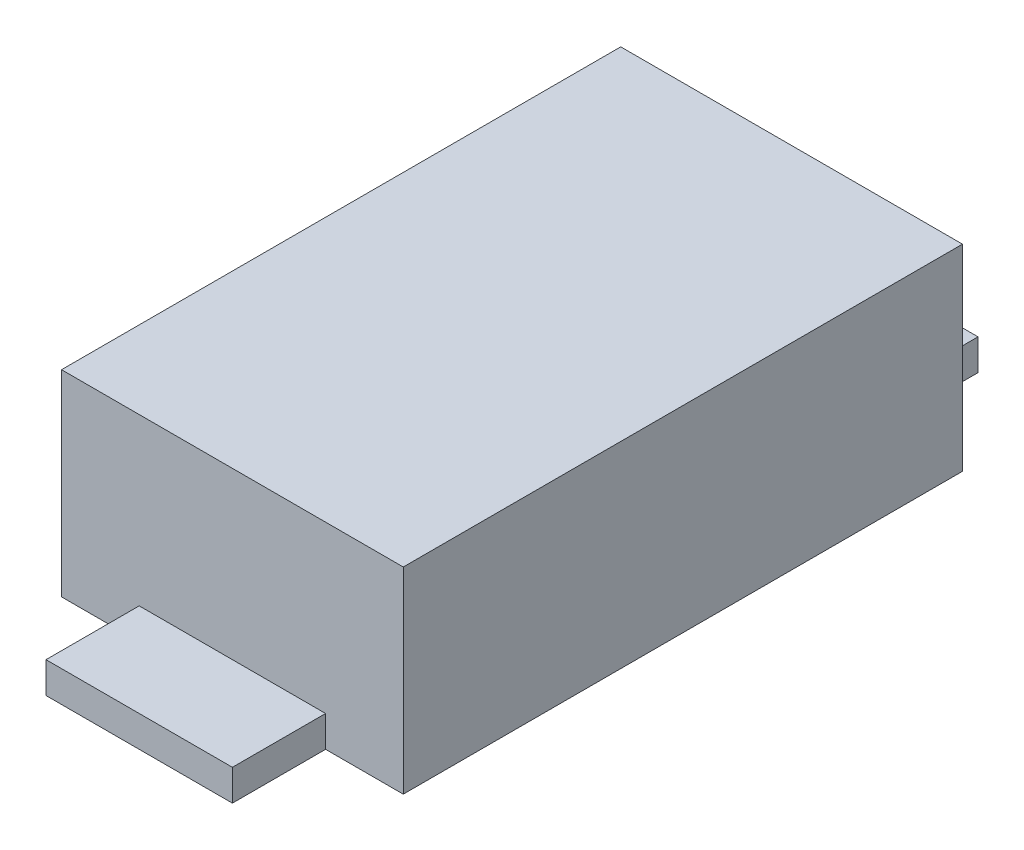
ISO-10303-21;
HEADER;
FILE_DESCRIPTION(('STEP AP214'),'2;1');
FILE_NAME('part.step','',(''),(''),'','','');
FILE_SCHEMA(('AUTOMOTIVE_DESIGN { 1 0 10303 214 1 1 1 1 }'));
ENDSEC;
DATA;
#1=APPLICATION_CONTEXT('core data for automotive mechanical design processes');
#2=APPLICATION_PROTOCOL_DEFINITION('international standard','automotive_design',2000,#1);
#3=PRODUCT_CONTEXT('',#1,'mechanical');
#4=PRODUCT('Part','Part','',(#3));
#5=PRODUCT_RELATED_PRODUCT_CATEGORY('part','',(#4));
#6=PRODUCT_DEFINITION_FORMATION('','',#4);
#7=PRODUCT_DEFINITION_CONTEXT('part definition',#1,'design');
#8=PRODUCT_DEFINITION('design','',#6,#7);
#9=PRODUCT_DEFINITION_SHAPE('','',#8);
#10=(LENGTH_UNIT() NAMED_UNIT(*) SI_UNIT(.MILLI.,.METRE.));
#11=(NAMED_UNIT(*) PLANE_ANGLE_UNIT() SI_UNIT($,.RADIAN.));
#12=(NAMED_UNIT(*) SI_UNIT($,.STERADIAN.) SOLID_ANGLE_UNIT());
#13=UNCERTAINTY_MEASURE_WITH_UNIT(LENGTH_MEASURE(1.E-05),#10,'distance_accuracy_value','');
#14=(GEOMETRIC_REPRESENTATION_CONTEXT(3) GLOBAL_UNCERTAINTY_ASSIGNED_CONTEXT((#13)) GLOBAL_UNIT_ASSIGNED_CONTEXT((#10,
#11,#12)) REPRESENTATION_CONTEXT('',''));
#15=CARTESIAN_POINT('',(0.,0.,0.));
#16=DIRECTION('',(0.,0.,1.));
#17=DIRECTION('',(1.,0.,0.));
#18=AXIS2_PLACEMENT_3D('',#15,#16,#17);
#19=CARTESIAN_POINT('',(-0.825,0.95,1.35));
#20=DIRECTION('',(0.,0.,-1.));
#21=DIRECTION('',(-1.,0.,0.));
#22=AXIS2_PLACEMENT_3D('',#19,#20,#21);
#23=PLANE('',#22);
#24=DIRECTION('',(0.,-1.,0.));
#25=VECTOR('',#24,1.);
#26=CARTESIAN_POINT('',(-0.45,0.15,1.35));
#27=LINE('',#26,#25);
#28=CARTESIAN_POINT('',(-0.45,0.15,1.35));
#29=VERTEX_POINT('',#28);
#30=CARTESIAN_POINT('',(-0.45,0.,1.35));
#31=VERTEX_POINT('',#30);
#32=EDGE_CURVE('E164',#29,#31,#27,.T.);
#33=ORIENTED_EDGE('',*,*,#32,.F.);
#34=DIRECTION('',(1.,0.,0.));
#35=VECTOR('',#34,1.);
#36=CARTESIAN_POINT('',(-0.45,0.15,1.35));
#37=LINE('',#36,#35);
#38=CARTESIAN_POINT('',(0.45,0.15,1.35));
#39=VERTEX_POINT('',#38);
#40=EDGE_CURVE('E155',#29,#39,#37,.T.);
#41=ORIENTED_EDGE('',*,*,#40,.T.);
#42=DIRECTION('',(0.,-1.,0.));
#43=VECTOR('',#42,1.);
#44=CARTESIAN_POINT('',(0.45,0.15,1.35));
#45=LINE('',#44,#43);
#46=CARTESIAN_POINT('',(0.45,0.,1.35));
#47=VERTEX_POINT('',#46);
#48=EDGE_CURVE('E170',#39,#47,#45,.T.);
#49=ORIENTED_EDGE('',*,*,#48,.T.);
#50=DIRECTION('',(1.,0.,0.));
#51=VECTOR('',#50,1.);
#52=CARTESIAN_POINT('',(-0.825,0.,1.35));
#53=LINE('',#52,#51);
#54=CARTESIAN_POINT('',(0.825,0.,1.35));
#55=VERTEX_POINT('',#54);
#56=EDGE_CURVE('E215',#47,#55,#53,.T.);
#57=ORIENTED_EDGE('',*,*,#56,.T.);
#58=DIRECTION('',(0.,-1.,0.));
#59=VECTOR('',#58,1.);
#60=CARTESIAN_POINT('',(0.825,0.95,1.35));
#61=LINE('',#60,#59);
#62=CARTESIAN_POINT('',(0.825,0.95,1.35));
#63=VERTEX_POINT('',#62);
#64=EDGE_CURVE('E206',#63,#55,#61,.T.);
#65=ORIENTED_EDGE('',*,*,#64,.F.);
#66=DIRECTION('',(1.,0.,0.));
#67=VECTOR('',#66,1.);
#68=CARTESIAN_POINT('',(-0.825,0.95,1.35));
#69=LINE('',#68,#67);
#70=CARTESIAN_POINT('',(-0.825,0.95,1.35));
#71=VERTEX_POINT('',#70);
#72=EDGE_CURVE('E204',#71,#63,#69,.T.);
#73=ORIENTED_EDGE('',*,*,#72,.F.);
#74=DIRECTION('',(0.,-1.,0.));
#75=VECTOR('',#74,1.);
#76=CARTESIAN_POINT('',(-0.825,0.95,1.35));
#77=LINE('',#76,#75);
#78=CARTESIAN_POINT('',(-0.825,0.,1.35));
#79=VERTEX_POINT('',#78);
#80=EDGE_CURVE('E220',#71,#79,#77,.T.);
#81=ORIENTED_EDGE('',*,*,#80,.T.);
#82=EDGE_CURVE('E200',#79,#31,#53,.T.);
#83=ORIENTED_EDGE('',*,*,#82,.T.);
#84=EDGE_LOOP('',(#33,#41,#49,#57,#65,#73,#81,#83));
#85=FACE_BOUND('',#84,.T.);
#86=ADVANCED_FACE('F45',(#85),#23,.F.);
#87=CARTESIAN_POINT('',(-0.825000000000001,0.95,-1.35));
#88=DIRECTION('',(0.,0.,1.));
#89=DIRECTION('',(1.,0.,0.));
#90=AXIS2_PLACEMENT_3D('',#87,#88,#89);
#91=PLANE('',#90);
#92=DIRECTION('',(0.,-1.,0.));
#93=VECTOR('',#92,1.);
#94=CARTESIAN_POINT('',(0.45,0.15,-1.35));
#95=LINE('',#94,#93);
#96=CARTESIAN_POINT('',(0.45,0.15,-1.35));
#97=VERTEX_POINT('',#96);
#98=CARTESIAN_POINT('',(0.45,0.,-1.35));
#99=VERTEX_POINT('',#98);
#100=EDGE_CURVE('E191',#97,#99,#95,.T.);
#101=ORIENTED_EDGE('',*,*,#100,.F.);
#102=DIRECTION('',(1.,0.,0.));
#103=VECTOR('',#102,1.);
#104=CARTESIAN_POINT('',(-0.45,0.15,-1.35));
#105=LINE('',#104,#103);
#106=CARTESIAN_POINT('',(-0.45,0.15,-1.35));
#107=VERTEX_POINT('',#106);
#108=EDGE_CURVE('E175',#107,#97,#105,.T.);
#109=ORIENTED_EDGE('',*,*,#108,.F.);
#110=DIRECTION('',(0.,-1.,0.));
#111=VECTOR('',#110,1.);
#112=CARTESIAN_POINT('',(-0.45,0.15,-1.35));
#113=LINE('',#112,#111);
#114=CARTESIAN_POINT('',(-0.45,0.,-1.35));
#115=VERTEX_POINT('',#114);
#116=EDGE_CURVE('E193',#107,#115,#113,.T.);
#117=ORIENTED_EDGE('',*,*,#116,.T.);
#118=DIRECTION('',(-1.,0.,0.));
#119=VECTOR('',#118,1.);
#120=CARTESIAN_POINT('',(-0.825000000000001,0.,-1.35));
#121=LINE('',#120,#119);
#122=CARTESIAN_POINT('',(-0.825000000000001,0.,-1.35));
#123=VERTEX_POINT('',#122);
#124=EDGE_CURVE('E209',#115,#123,#121,.T.);
#125=ORIENTED_EDGE('',*,*,#124,.T.);
#126=DIRECTION('',(0.,-1.,0.));
#127=VECTOR('',#126,1.);
#128=CARTESIAN_POINT('',(-0.825000000000001,0.95,-1.35));
#129=LINE('',#128,#127);
#130=CARTESIAN_POINT('',(-0.825000000000001,0.95,-1.35));
#131=VERTEX_POINT('',#130);
#132=EDGE_CURVE('E53',#131,#123,#129,.T.);
#133=ORIENTED_EDGE('',*,*,#132,.F.);
#134=DIRECTION('',(-1.,0.,0.));
#135=VECTOR('',#134,1.);
#136=CARTESIAN_POINT('',(-0.825000000000001,0.95,-1.35));
#137=LINE('',#136,#135);
#138=CARTESIAN_POINT('',(0.824999999999999,0.95,-1.35));
#139=VERTEX_POINT('',#138);
#140=EDGE_CURVE('E199',#139,#131,#137,.T.);
#141=ORIENTED_EDGE('',*,*,#140,.F.);
#142=DIRECTION('',(0.,-1.,0.));
#143=VECTOR('',#142,1.);
#144=CARTESIAN_POINT('',(0.824999999999999,0.95,-1.35));
#145=LINE('',#144,#143);
#146=CARTESIAN_POINT('',(0.824999999999999,0.,-1.35));
#147=VERTEX_POINT('',#146);
#148=EDGE_CURVE('E11',#139,#147,#145,.T.);
#149=ORIENTED_EDGE('',*,*,#148,.T.);
#150=EDGE_CURVE('E210',#147,#99,#121,.T.);
#151=ORIENTED_EDGE('',*,*,#150,.T.);
#152=EDGE_LOOP('',(#101,#109,#117,#125,#133,#141,#149,#151));
#153=FACE_BOUND('',#152,.T.);
#154=ADVANCED_FACE('F243',(#153),#91,.F.);
#155=CARTESIAN_POINT('',(0.824999999999999,0.95,-1.35));
#156=DIRECTION('',(-1.,0.,0.));
#157=DIRECTION('',(0.,0.,1.));
#158=AXIS2_PLACEMENT_3D('',#155,#156,#157);
#159=PLANE('',#158);
#160=DIRECTION('',(0.,0.,-1.));
#161=VECTOR('',#160,1.);
#162=CARTESIAN_POINT('',(0.824999999999999,0.,-1.35));
#163=LINE('',#162,#161);
#164=EDGE_CURVE('E195',#55,#147,#163,.T.);
#165=ORIENTED_EDGE('',*,*,#164,.T.);
#166=ORIENTED_EDGE('',*,*,#148,.F.);
#167=DIRECTION('',(0.,0.,-1.));
#168=VECTOR('',#167,1.);
#169=CARTESIAN_POINT('',(0.824999999999999,0.95,-1.35));
#170=LINE('',#169,#168);
#171=EDGE_CURVE('E196',#63,#139,#170,.T.);
#172=ORIENTED_EDGE('',*,*,#171,.F.);
#173=ORIENTED_EDGE('',*,*,#64,.T.);
#174=EDGE_LOOP('',(#165,#166,#172,#173));
#175=FACE_BOUND('',#174,.T.);
#176=ADVANCED_FACE('F47',(#175),#159,.F.);
#177=CARTESIAN_POINT('',(-0.825000000000001,0.95,-1.35));
#178=DIRECTION('',(1.,0.,0.));
#179=DIRECTION('',(0.,0.,-1.));
#180=AXIS2_PLACEMENT_3D('',#177,#178,#179);
#181=PLANE('',#180);
#182=DIRECTION('',(0.,0.,1.));
#183=VECTOR('',#182,1.);
#184=CARTESIAN_POINT('',(-0.825000000000001,0.,-1.35));
#185=LINE('',#184,#183);
#186=EDGE_CURVE('E213',#123,#79,#185,.T.);
#187=ORIENTED_EDGE('',*,*,#186,.T.);
#188=ORIENTED_EDGE('',*,*,#80,.F.);
#189=DIRECTION('',(0.,0.,1.));
#190=VECTOR('',#189,1.);
#191=CARTESIAN_POINT('',(-0.825000000000001,0.95,-1.35));
#192=LINE('',#191,#190);
#193=EDGE_CURVE('E202',#131,#71,#192,.T.);
#194=ORIENTED_EDGE('',*,*,#193,.F.);
#195=ORIENTED_EDGE('',*,*,#132,.T.);
#196=EDGE_LOOP('',(#187,#188,#194,#195));
#197=FACE_BOUND('',#196,.T.);
#198=ADVANCED_FACE('F227',(#197),#181,.F.);
#199=CARTESIAN_POINT('',(0.,0.95,0.));
#200=DIRECTION('',(0.,1.,0.));
#201=DIRECTION('',(0.,0.,1.));
#202=AXIS2_PLACEMENT_3D('',#199,#200,#201);
#203=PLANE('',#202);
#204=ORIENTED_EDGE('',*,*,#171,.T.);
#205=ORIENTED_EDGE('',*,*,#140,.T.);
#206=ORIENTED_EDGE('',*,*,#193,.T.);
#207=ORIENTED_EDGE('',*,*,#72,.T.);
#208=EDGE_LOOP('',(#204,#205,#206,#207));
#209=FACE_BOUND('',#208,.T.);
#210=ADVANCED_FACE('F240',(#209),#203,.T.);
#211=CARTESIAN_POINT('',(0.,0.,0.));
#212=DIRECTION('',(0.,1.,0.));
#213=DIRECTION('',(0.,0.,1.));
#214=AXIS2_PLACEMENT_3D('',#211,#212,#213);
#215=PLANE('',#214);
#216=ORIENTED_EDGE('',*,*,#164,.F.);
#217=ORIENTED_EDGE('',*,*,#56,.F.);
#218=DIRECTION('',(0.,0.,1.));
#219=VECTOR('',#218,1.);
#220=CARTESIAN_POINT('',(0.45,0.,1.35));
#221=LINE('',#220,#219);
#222=CARTESIAN_POINT('',(0.45,0.,1.8));
#223=VERTEX_POINT('',#222);
#224=EDGE_CURVE('E60',#47,#223,#221,.T.);
#225=ORIENTED_EDGE('',*,*,#224,.T.);
#226=DIRECTION('',(-1.,0.,0.));
#227=VECTOR('',#226,1.);
#228=CARTESIAN_POINT('',(-0.45,0.,1.8));
#229=LINE('',#228,#227);
#230=CARTESIAN_POINT('',(-0.45,0.,1.8));
#231=VERTEX_POINT('',#230);
#232=EDGE_CURVE('E166',#223,#231,#229,.T.);
#233=ORIENTED_EDGE('',*,*,#232,.T.);
#234=DIRECTION('',(0.,0.,-1.));
#235=VECTOR('',#234,1.);
#236=CARTESIAN_POINT('',(-0.45,0.,1.35));
#237=LINE('',#236,#235);
#238=EDGE_CURVE('E141',#231,#31,#237,.T.);
#239=ORIENTED_EDGE('',*,*,#238,.T.);
#240=ORIENTED_EDGE('',*,*,#82,.F.);
#241=ORIENTED_EDGE('',*,*,#186,.F.);
#242=ORIENTED_EDGE('',*,*,#124,.F.);
#243=DIRECTION('',(0.,0.,1.));
#244=VECTOR('',#243,1.);
#245=CARTESIAN_POINT('',(-0.45,0.,-1.35));
#246=LINE('',#245,#244);
#247=CARTESIAN_POINT('',(-0.45,0.,-1.8));
#248=VERTEX_POINT('',#247);
#249=EDGE_CURVE('E68',#248,#115,#246,.T.);
#250=ORIENTED_EDGE('',*,*,#249,.F.);
#251=DIRECTION('',(-1.,0.,0.));
#252=VECTOR('',#251,1.);
#253=CARTESIAN_POINT('',(-0.45,0.,-1.8));
#254=LINE('',#253,#252);
#255=CARTESIAN_POINT('',(0.45,0.,-1.8));
#256=VERTEX_POINT('',#255);
#257=EDGE_CURVE('E176',#256,#248,#254,.T.);
#258=ORIENTED_EDGE('',*,*,#257,.F.);
#259=DIRECTION('',(0.,0.,-1.));
#260=VECTOR('',#259,1.);
#261=CARTESIAN_POINT('',(0.45,0.,-1.35));
#262=LINE('',#261,#260);
#263=EDGE_CURVE('E184',#99,#256,#262,.T.);
#264=ORIENTED_EDGE('',*,*,#263,.F.);
#265=ORIENTED_EDGE('',*,*,#150,.F.);
#266=EDGE_LOOP('',(#216,#217,#225,#233,#239,#240,#241,#242,#250,#258,#264,#265));
#267=FACE_BOUND('',#266,.T.);
#268=ADVANCED_FACE('F234',(#267),#215,.F.);
#269=CARTESIAN_POINT('',(-0.45,0.15,-1.35));
#270=DIRECTION('',(1.,0.,0.));
#271=DIRECTION('',(0.,0.,-1.));
#272=AXIS2_PLACEMENT_3D('',#269,#270,#271);
#273=PLANE('',#272);
#274=ORIENTED_EDGE('',*,*,#249,.T.);
#275=ORIENTED_EDGE('',*,*,#116,.F.);
#276=DIRECTION('',(0.,0.,1.));
#277=VECTOR('',#276,1.);
#278=CARTESIAN_POINT('',(-0.45,0.15,-1.35));
#279=LINE('',#278,#277);
#280=CARTESIAN_POINT('',(-0.45,0.15,-1.8));
#281=VERTEX_POINT('',#280);
#282=EDGE_CURVE('E173',#281,#107,#279,.T.);
#283=ORIENTED_EDGE('',*,*,#282,.F.);
#284=DIRECTION('',(0.,-1.,0.));
#285=VECTOR('',#284,1.);
#286=CARTESIAN_POINT('',(-0.45,0.15,-1.8));
#287=LINE('',#286,#285);
#288=EDGE_CURVE('E182',#281,#248,#287,.T.);
#289=ORIENTED_EDGE('',*,*,#288,.T.);
#290=EDGE_LOOP('',(#274,#275,#283,#289));
#291=FACE_BOUND('',#290,.T.);
#292=ADVANCED_FACE('F260',(#291),#273,.F.);
#293=CARTESIAN_POINT('',(0.45,0.15,-1.35));
#294=DIRECTION('',(-1.,0.,0.));
#295=DIRECTION('',(0.,0.,1.));
#296=AXIS2_PLACEMENT_3D('',#293,#294,#295);
#297=PLANE('',#296);
#298=ORIENTED_EDGE('',*,*,#263,.T.);
#299=DIRECTION('',(0.,-1.,0.));
#300=VECTOR('',#299,1.);
#301=CARTESIAN_POINT('',(0.45,0.15,-1.8));
#302=LINE('',#301,#300);
#303=CARTESIAN_POINT('',(0.45,0.15,-1.8));
#304=VERTEX_POINT('',#303);
#305=EDGE_CURVE('E188',#304,#256,#302,.T.);
#306=ORIENTED_EDGE('',*,*,#305,.F.);
#307=DIRECTION('',(0.,0.,-1.));
#308=VECTOR('',#307,1.);
#309=CARTESIAN_POINT('',(0.45,0.15,-1.35));
#310=LINE('',#309,#308);
#311=EDGE_CURVE('E178',#97,#304,#310,.T.);
#312=ORIENTED_EDGE('',*,*,#311,.F.);
#313=ORIENTED_EDGE('',*,*,#100,.T.);
#314=EDGE_LOOP('',(#298,#306,#312,#313));
#315=FACE_BOUND('',#314,.T.);
#316=ADVANCED_FACE('F250',(#315),#297,.F.);
#317=CARTESIAN_POINT('',(-0.45,0.15,-1.8));
#318=DIRECTION('',(0.,0.,1.));
#319=DIRECTION('',(1.,0.,0.));
#320=AXIS2_PLACEMENT_3D('',#317,#318,#319);
#321=PLANE('',#320);
#322=ORIENTED_EDGE('',*,*,#257,.T.);
#323=ORIENTED_EDGE('',*,*,#288,.F.);
#324=DIRECTION('',(-1.,0.,0.));
#325=VECTOR('',#324,1.);
#326=CARTESIAN_POINT('',(-0.45,0.15,-1.8));
#327=LINE('',#326,#325);
#328=EDGE_CURVE('E180',#304,#281,#327,.T.);
#329=ORIENTED_EDGE('',*,*,#328,.F.);
#330=ORIENTED_EDGE('',*,*,#305,.T.);
#331=EDGE_LOOP('',(#322,#323,#329,#330));
#332=FACE_BOUND('',#331,.T.);
#333=ADVANCED_FACE('F254',(#332),#321,.F.);
#334=CARTESIAN_POINT('',(0.,0.15,0.));
#335=DIRECTION('',(0.,-1.,0.));
#336=DIRECTION('',(0.,0.,-1.));
#337=AXIS2_PLACEMENT_3D('',#334,#335,#336);
#338=PLANE('',#337);
#339=ORIENTED_EDGE('',*,*,#282,.T.);
#340=ORIENTED_EDGE('',*,*,#108,.T.);
#341=ORIENTED_EDGE('',*,*,#311,.T.);
#342=ORIENTED_EDGE('',*,*,#328,.T.);
#343=EDGE_LOOP('',(#339,#340,#341,#342));
#344=FACE_BOUND('',#343,.T.);
#345=ADVANCED_FACE('F258',(#344),#338,.F.);
#346=CARTESIAN_POINT('',(-0.45,0.15,1.35));
#347=DIRECTION('',(-1.,0.,0.));
#348=DIRECTION('',(0.,0.,1.));
#349=AXIS2_PLACEMENT_3D('',#346,#347,#348);
#350=PLANE('',#349);
#351=ORIENTED_EDGE('',*,*,#238,.F.);
#352=DIRECTION('',(0.,-1.,0.));
#353=VECTOR('',#352,1.);
#354=CARTESIAN_POINT('',(-0.45,0.15,1.8));
#355=LINE('',#354,#353);
#356=CARTESIAN_POINT('',(-0.45,0.15,1.8));
#357=VERTEX_POINT('',#356);
#358=EDGE_CURVE('E135',#357,#231,#355,.T.);
#359=ORIENTED_EDGE('',*,*,#358,.F.);
#360=DIRECTION('',(0.,0.,-1.));
#361=VECTOR('',#360,1.);
#362=CARTESIAN_POINT('',(-0.45,0.15,1.35));
#363=LINE('',#362,#361);
#364=EDGE_CURVE('E138',#357,#29,#363,.T.);
#365=ORIENTED_EDGE('',*,*,#364,.T.);
#366=ORIENTED_EDGE('',*,*,#32,.T.);
#367=EDGE_LOOP('',(#351,#359,#365,#366));
#368=FACE_BOUND('',#367,.T.);
#369=ADVANCED_FACE('F137',(#368),#350,.T.);
#370=CARTESIAN_POINT('',(-0.45,0.15,1.8));
#371=DIRECTION('',(0.,0.,1.));
#372=DIRECTION('',(1.,0.,0.));
#373=AXIS2_PLACEMENT_3D('',#370,#371,#372);
#374=PLANE('',#373);
#375=ORIENTED_EDGE('',*,*,#232,.F.);
#376=DIRECTION('',(0.,-1.,0.));
#377=VECTOR('',#376,1.);
#378=CARTESIAN_POINT('',(0.45,0.15,1.8));
#379=LINE('',#378,#377);
#380=CARTESIAN_POINT('',(0.45,0.15,1.8));
#381=VERTEX_POINT('',#380);
#382=EDGE_CURVE('E146',#381,#223,#379,.T.);
#383=ORIENTED_EDGE('',*,*,#382,.F.);
#384=DIRECTION('',(-1.,0.,0.));
#385=VECTOR('',#384,1.);
#386=CARTESIAN_POINT('',(-0.45,0.15,1.8));
#387=LINE('',#386,#385);
#388=EDGE_CURVE('E152',#381,#357,#387,.T.);
#389=ORIENTED_EDGE('',*,*,#388,.T.);
#390=ORIENTED_EDGE('',*,*,#358,.T.);
#391=EDGE_LOOP('',(#375,#383,#389,#390));
#392=FACE_BOUND('',#391,.T.);
#393=ADVANCED_FACE('F158',(#392),#374,.T.);
#394=CARTESIAN_POINT('',(0.45,0.15,1.35));
#395=DIRECTION('',(1.,0.,0.));
#396=DIRECTION('',(0.,0.,-1.));
#397=AXIS2_PLACEMENT_3D('',#394,#395,#396);
#398=PLANE('',#397);
#399=ORIENTED_EDGE('',*,*,#224,.F.);
#400=ORIENTED_EDGE('',*,*,#48,.F.);
#401=DIRECTION('',(0.,0.,1.));
#402=VECTOR('',#401,1.);
#403=CARTESIAN_POINT('',(0.45,0.15,1.35));
#404=LINE('',#403,#402);
#405=EDGE_CURVE('E159',#39,#381,#404,.T.);
#406=ORIENTED_EDGE('',*,*,#405,.T.);
#407=ORIENTED_EDGE('',*,*,#382,.T.);
#408=EDGE_LOOP('',(#399,#400,#406,#407));
#409=FACE_BOUND('',#408,.T.);
#410=ADVANCED_FACE('F330',(#409),#398,.T.);
#411=CARTESIAN_POINT('',(0.,0.15,0.));
#412=DIRECTION('',(0.,-1.,0.));
#413=DIRECTION('',(0.,0.,1.));
#414=AXIS2_PLACEMENT_3D('',#411,#412,#413);
#415=PLANE('',#414);
#416=ORIENTED_EDGE('',*,*,#364,.F.);
#417=ORIENTED_EDGE('',*,*,#388,.F.);
#418=ORIENTED_EDGE('',*,*,#405,.F.);
#419=ORIENTED_EDGE('',*,*,#40,.F.);
#420=EDGE_LOOP('',(#416,#417,#418,#419));
#421=FACE_BOUND('',#420,.T.);
#422=ADVANCED_FACE('F150',(#421),#415,.F.);
#423=CLOSED_SHELL('',(#86,#154,#176,#198,#210,#268,#292,#316,#333,#345,#369,#393,#410,#422));
#424=MANIFOLD_SOLID_BREP('B2',#423);
#425=ADVANCED_BREP_SHAPE_REPRESENTATION('',(#18,#424),#14);
#426=SHAPE_DEFINITION_REPRESENTATION(#9,#425);
ENDSEC;
END-ISO-10303-21;
